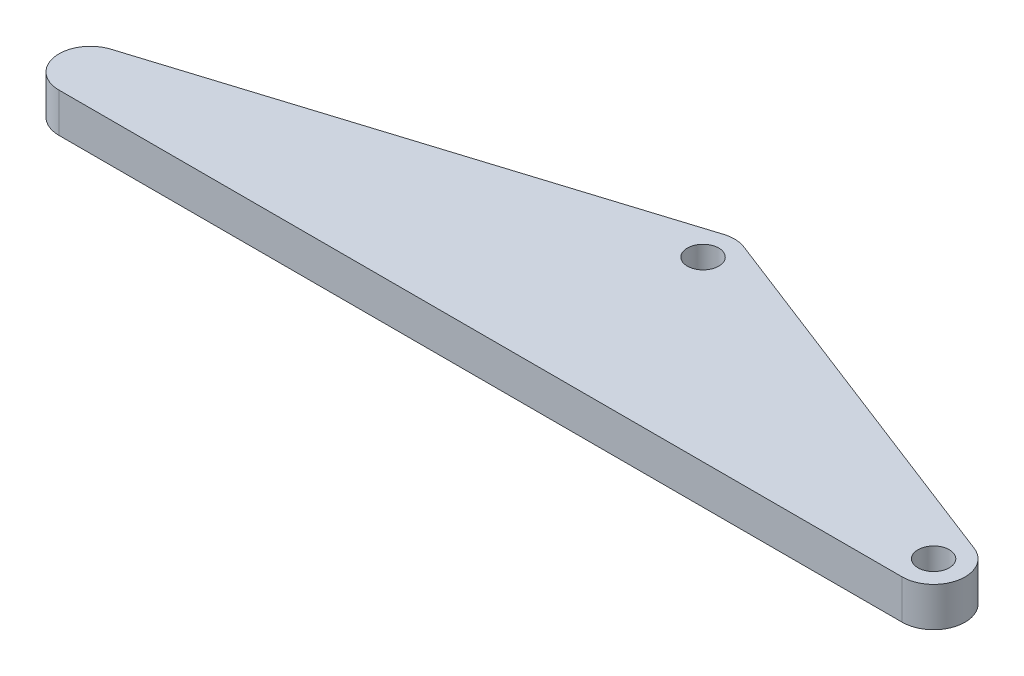
ISO-10303-21;
HEADER;
FILE_DESCRIPTION(('STEP AP214'),'2;1');
FILE_NAME('part.step','',(''),(''),'','','');
FILE_SCHEMA(('AUTOMOTIVE_DESIGN { 1 0 10303 214 1 1 1 1 }'));
ENDSEC;
DATA;
#1=APPLICATION_CONTEXT('core data for automotive mechanical design processes');
#2=APPLICATION_PROTOCOL_DEFINITION('international standard','automotive_design',2000,#1);
#3=PRODUCT_CONTEXT('',#1,'mechanical');
#4=PRODUCT('Part','Part','',(#3));
#5=PRODUCT_RELATED_PRODUCT_CATEGORY('part','',(#4));
#6=PRODUCT_DEFINITION_FORMATION('','',#4);
#7=PRODUCT_DEFINITION_CONTEXT('part definition',#1,'design');
#8=PRODUCT_DEFINITION('design','',#6,#7);
#9=PRODUCT_DEFINITION_SHAPE('','',#8);
#10=(LENGTH_UNIT() NAMED_UNIT(*) SI_UNIT(.MILLI.,.METRE.));
#11=(NAMED_UNIT(*) PLANE_ANGLE_UNIT() SI_UNIT($,.RADIAN.));
#12=(NAMED_UNIT(*) SI_UNIT($,.STERADIAN.) SOLID_ANGLE_UNIT());
#13=UNCERTAINTY_MEASURE_WITH_UNIT(LENGTH_MEASURE(1.E-05),#10,'distance_accuracy_value','');
#14=(GEOMETRIC_REPRESENTATION_CONTEXT(3) GLOBAL_UNCERTAINTY_ASSIGNED_CONTEXT((#13)) GLOBAL_UNIT_ASSIGNED_CONTEXT((#10,
#11,#12)) REPRESENTATION_CONTEXT('',''));
#15=CARTESIAN_POINT('',(0.,0.,0.));
#16=DIRECTION('',(0.,0.,1.));
#17=DIRECTION('',(1.,0.,0.));
#18=AXIS2_PLACEMENT_3D('',#15,#16,#17);
#19=CARTESIAN_POINT('',(8.45846730355585,5.,-21.8175835679385));
#20=DIRECTION('',(0.361475397059794,0.,-0.932381647889138));
#21=DIRECTION('',(-0.932381647889138,0.,-0.361475397059794));
#22=AXIS2_PLACEMENT_3D('',#19,#20,#21);
#23=PLANE('',#22);
#24=DIRECTION('',(0.932381647889138,0.,0.361475397059794));
#25=VECTOR('',#24,1.);
#26=CARTESIAN_POINT('',(8.45846730355585,0.,-21.8175835679385));
#27=LINE('',#26,#25);
#28=CARTESIAN_POINT('',(7.18440158823917,0.,-22.3115265915566));
#29=VERTEX_POINT('',#28);
#30=CARTESIAN_POINT('',(55.1144015882392,0.,-3.72952659155658));
#31=VERTEX_POINT('',#30);
#32=EDGE_CURVE('E123',#29,#31,#27,.T.);
#33=ORIENTED_EDGE('',*,*,#32,.F.);
#34=DIRECTION('',(0.,-1.,0.));
#35=VECTOR('',#34,1.);
#36=CARTESIAN_POINT('',(7.18440158823917,5.,-22.3115265915566));
#37=LINE('',#36,#35);
#38=CARTESIAN_POINT('',(7.18440158823917,5.,-22.3115265915566));
#39=VERTEX_POINT('',#38);
#40=EDGE_CURVE('E11',#39,#29,#37,.T.);
#41=ORIENTED_EDGE('',*,*,#40,.F.);
#42=DIRECTION('',(0.932381647889138,0.,0.361475397059794));
#43=VECTOR('',#42,1.);
#44=CARTESIAN_POINT('',(8.45846730355585,5.,-21.8175835679385));
#45=LINE('',#44,#43);
#46=CARTESIAN_POINT('',(55.1144015882392,5.,-3.72952659155658));
#47=VERTEX_POINT('',#46);
#48=EDGE_CURVE('E142',#39,#47,#45,.T.);
#49=ORIENTED_EDGE('',*,*,#48,.T.);
#50=DIRECTION('',(0.,-1.,0.));
#51=VECTOR('',#50,1.);
#52=CARTESIAN_POINT('',(55.1144015882392,5.,-3.72952659155658));
#53=LINE('',#52,#51);
#54=EDGE_CURVE('E81',#47,#31,#53,.T.);
#55=ORIENTED_EDGE('',*,*,#54,.T.);
#56=EDGE_LOOP('',(#33,#41,#49,#55));
#57=FACE_BOUND('',#56,.T.);
#58=ADVANCED_FACE('F36',(#57),#23,.T.);
#59=CARTESIAN_POINT('',(5.73849999999999,5.,-18.582));
#60=DIRECTION('',(0.,-1.,0.));
#61=DIRECTION('',(0.,0.,-1.));
#62=AXIS2_PLACEMENT_3D('',#59,#60,#61);
#63=CYLINDRICAL_SURFACE('',#62,4.);
#64=CARTESIAN_POINT('',(5.73849999999999,0.,-18.582));
#65=DIRECTION('',(0.,1.,0.));
#66=DIRECTION('',(0.,0.,1.));
#67=AXIS2_PLACEMENT_3D('',#64,#65,#66);
#68=CIRCLE('',#67,4.);
#69=CARTESIAN_POINT('',(4.54438651623012,0.,-22.3996030422084));
#70=VERTEX_POINT('',#69);
#71=EDGE_CURVE('E126',#29,#70,#68,.T.);
#72=ORIENTED_EDGE('',*,*,#71,.T.);
#73=DIRECTION('',(0.,-1.,0.));
#74=VECTOR('',#73,1.);
#75=CARTESIAN_POINT('',(4.54438651623012,5.,-22.3996030422084));
#76=LINE('',#75,#74);
#77=CARTESIAN_POINT('',(4.54438651623012,5.,-22.3996030422084));
#78=VERTEX_POINT('',#77);
#79=EDGE_CURVE('E44',#78,#70,#76,.T.);
#80=ORIENTED_EDGE('',*,*,#79,.F.);
#81=CARTESIAN_POINT('',(5.73849999999999,5.,-18.582));
#82=DIRECTION('',(0.,1.,0.));
#83=DIRECTION('',(0.,0.,1.));
#84=AXIS2_PLACEMENT_3D('',#81,#82,#83);
#85=CIRCLE('',#84,4.);
#86=EDGE_CURVE('E158',#39,#78,#85,.T.);
#87=ORIENTED_EDGE('',*,*,#86,.F.);
#88=ORIENTED_EDGE('',*,*,#40,.T.);
#89=EDGE_LOOP('',(#72,#80,#87,#88));
#90=FACE_BOUND('',#89,.T.);
#91=ADVANCED_FACE('F151',(#90),#63,.T.);
#92=CARTESIAN_POINT('',(-5.97700663877095,5.,-19.1086015170308));
#93=DIRECTION('',(-0.298528370942468,0.,-0.954400760552105));
#94=DIRECTION('',(-0.954400760552105,0.,0.298528370942468));
#95=AXIS2_PLACEMENT_3D('',#92,#93,#94);
#96=PLANE('',#95);
#97=DIRECTION('',(0.954400760552105,0.,-0.298528370942468));
#98=VECTOR('',#97,1.);
#99=CARTESIAN_POINT('',(-5.97700663877095,0.,-19.1086015170308));
#100=LINE('',#99,#98);
#101=CARTESIAN_POINT('',(-54.8626134837699,0.,-3.81760304220843));
#102=VERTEX_POINT('',#101);
#103=EDGE_CURVE('E129',#102,#70,#100,.T.);
#104=ORIENTED_EDGE('',*,*,#103,.F.);
#105=DIRECTION('',(0.,-1.,0.));
#106=VECTOR('',#105,1.);
#107=CARTESIAN_POINT('',(-54.8626134837699,5.,-3.81760304220843));
#108=LINE('',#107,#106);
#109=CARTESIAN_POINT('',(-54.8626134837699,5.,-3.81760304220843));
#110=VERTEX_POINT('',#109);
#111=EDGE_CURVE('E109',#110,#102,#108,.T.);
#112=ORIENTED_EDGE('',*,*,#111,.F.);
#113=DIRECTION('',(0.954400760552105,0.,-0.298528370942468));
#114=VECTOR('',#113,1.);
#115=CARTESIAN_POINT('',(-5.97700663877095,5.,-19.1086015170308));
#116=LINE('',#115,#114);
#117=EDGE_CURVE('E102',#110,#78,#116,.T.);
#118=ORIENTED_EDGE('',*,*,#117,.T.);
#119=ORIENTED_EDGE('',*,*,#79,.T.);
#120=EDGE_LOOP('',(#104,#112,#118,#119));
#121=FACE_BOUND('',#120,.T.);
#122=ADVANCED_FACE('F148',(#121),#96,.T.);
#123=CARTESIAN_POINT('',(-53.6685,5.,0.));
#124=DIRECTION('',(0.,-1.,0.));
#125=DIRECTION('',(0.,0.,-1.));
#126=AXIS2_PLACEMENT_3D('',#123,#124,#125);
#127=CYLINDRICAL_SURFACE('',#126,4.00000000000002);
#128=CARTESIAN_POINT('',(-53.6685,0.,0.));
#129=DIRECTION('',(0.,1.,0.));
#130=DIRECTION('',(0.,0.,1.));
#131=AXIS2_PLACEMENT_3D('',#128,#129,#130);
#132=CIRCLE('',#131,4.00000000000002);
#133=CARTESIAN_POINT('',(-53.6685,0.,4.00000000000002));
#134=VERTEX_POINT('',#133);
#135=EDGE_CURVE('E108',#102,#134,#132,.T.);
#136=ORIENTED_EDGE('',*,*,#135,.T.);
#137=DIRECTION('',(0.,-1.,0.));
#138=VECTOR('',#137,1.);
#139=CARTESIAN_POINT('',(-53.6685,5.,4.00000000000002));
#140=LINE('',#139,#138);
#141=CARTESIAN_POINT('',(-53.6685,5.,4.00000000000002));
#142=VERTEX_POINT('',#141);
#143=EDGE_CURVE('E105',#142,#134,#140,.T.);
#144=ORIENTED_EDGE('',*,*,#143,.F.);
#145=CARTESIAN_POINT('',(-53.6685,5.,0.));
#146=DIRECTION('',(0.,1.,0.));
#147=DIRECTION('',(0.,0.,1.));
#148=AXIS2_PLACEMENT_3D('',#145,#146,#147);
#149=CIRCLE('',#148,4.00000000000002);
#150=EDGE_CURVE('E95',#110,#142,#149,.T.);
#151=ORIENTED_EDGE('',*,*,#150,.F.);
#152=ORIENTED_EDGE('',*,*,#111,.T.);
#153=EDGE_LOOP('',(#136,#144,#151,#152));
#154=FACE_BOUND('',#153,.T.);
#155=ADVANCED_FACE('F106',(#154),#127,.T.);
#156=CARTESIAN_POINT('',(0.,5.,4.00000000000002));
#157=DIRECTION('',(0.,0.,-1.));
#158=DIRECTION('',(-1.,0.,0.));
#159=AXIS2_PLACEMENT_3D('',#156,#157,#158);
#160=PLANE('',#159);
#161=DIRECTION('',(1.,0.,0.));
#162=VECTOR('',#161,1.);
#163=CARTESIAN_POINT('',(0.,0.,4.00000000000002));
#164=LINE('',#163,#162);
#165=CARTESIAN_POINT('',(53.6685,0.,4.));
#166=VERTEX_POINT('',#165);
#167=EDGE_CURVE('E74',#134,#166,#164,.T.);
#168=ORIENTED_EDGE('',*,*,#167,.T.);
#169=DIRECTION('',(0.,-1.,0.));
#170=VECTOR('',#169,1.);
#171=CARTESIAN_POINT('',(53.6685,5.,4.));
#172=LINE('',#171,#170);
#173=CARTESIAN_POINT('',(53.6685,5.,4.));
#174=VERTEX_POINT('',#173);
#175=EDGE_CURVE('E110',#174,#166,#172,.T.);
#176=ORIENTED_EDGE('',*,*,#175,.F.);
#177=DIRECTION('',(1.,0.,0.));
#178=VECTOR('',#177,1.);
#179=CARTESIAN_POINT('',(0.,5.,4.00000000000002));
#180=LINE('',#179,#178);
#181=EDGE_CURVE('E100',#142,#174,#180,.T.);
#182=ORIENTED_EDGE('',*,*,#181,.F.);
#183=ORIENTED_EDGE('',*,*,#143,.T.);
#184=EDGE_LOOP('',(#168,#176,#182,#183));
#185=FACE_BOUND('',#184,.T.);
#186=ADVANCED_FACE('F112',(#185),#160,.F.);
#187=CARTESIAN_POINT('',(53.6685,5.,0.));
#188=DIRECTION('',(0.,-1.,0.));
#189=DIRECTION('',(0.,0.,-1.));
#190=AXIS2_PLACEMENT_3D('',#187,#188,#189);
#191=CYLINDRICAL_SURFACE('',#190,2.);
#192=CARTESIAN_POINT('',(53.6685,5.,0.));
#193=DIRECTION('',(0.,1.,0.));
#194=DIRECTION('',(0.,0.,1.));
#195=AXIS2_PLACEMENT_3D('',#192,#193,#194);
#196=CIRCLE('',#195,2.);
#197=CARTESIAN_POINT('',(53.6685,5.,1.99999999999998));
#198=VERTEX_POINT('',#197);
#199=EDGE_CURVE('E114',#198,#198,#196,.T.);
#200=ORIENTED_EDGE('',*,*,#199,.T.);
#201=EDGE_LOOP('',(#200));
#202=FACE_BOUND('',#201,.T.);
#203=CARTESIAN_POINT('',(53.6685,0.,0.));
#204=DIRECTION('',(0.,1.,0.));
#205=DIRECTION('',(0.,0.,1.));
#206=AXIS2_PLACEMENT_3D('',#203,#204,#205);
#207=CIRCLE('',#206,2.);
#208=CARTESIAN_POINT('',(53.6685,0.,1.99999999999998));
#209=VERTEX_POINT('',#208);
#210=EDGE_CURVE('E136',#209,#209,#207,.T.);
#211=ORIENTED_EDGE('',*,*,#210,.F.);
#212=EDGE_LOOP('',(#211));
#213=FACE_BOUND('',#212,.T.);
#214=ADVANCED_FACE('F174',(#202,#213),#191,.F.);
#215=CARTESIAN_POINT('',(53.6685,5.,0.));
#216=DIRECTION('',(0.,-1.,0.));
#217=DIRECTION('',(0.,0.,-1.));
#218=AXIS2_PLACEMENT_3D('',#215,#216,#217);
#219=CYLINDRICAL_SURFACE('',#218,4.00000000000001);
#220=CARTESIAN_POINT('',(53.6685,0.,0.));
#221=DIRECTION('',(0.,1.,0.));
#222=DIRECTION('',(0.,0.,1.));
#223=AXIS2_PLACEMENT_3D('',#220,#221,#222);
#224=CIRCLE('',#223,4.00000000000001);
#225=EDGE_CURVE('E134',#166,#31,#224,.T.);
#226=ORIENTED_EDGE('',*,*,#225,.T.);
#227=ORIENTED_EDGE('',*,*,#54,.F.);
#228=CARTESIAN_POINT('',(53.6685,5.,0.));
#229=DIRECTION('',(0.,1.,0.));
#230=DIRECTION('',(0.,0.,1.));
#231=AXIS2_PLACEMENT_3D('',#228,#229,#230);
#232=CIRCLE('',#231,4.00000000000001);
#233=EDGE_CURVE('E52',#174,#47,#232,.T.);
#234=ORIENTED_EDGE('',*,*,#233,.F.);
#235=ORIENTED_EDGE('',*,*,#175,.T.);
#236=EDGE_LOOP('',(#226,#227,#234,#235));
#237=FACE_BOUND('',#236,.T.);
#238=ADVANCED_FACE('F157',(#237),#219,.T.);
#239=CARTESIAN_POINT('',(5.73849999999999,5.,-18.582));
#240=DIRECTION('',(0.,-1.,0.));
#241=DIRECTION('',(0.,0.,-1.));
#242=AXIS2_PLACEMENT_3D('',#239,#240,#241);
#243=CYLINDRICAL_SURFACE('',#242,2.);
#244=CARTESIAN_POINT('',(5.73849999999999,5.,-18.582));
#245=DIRECTION('',(0.,1.,0.));
#246=DIRECTION('',(0.,0.,1.));
#247=AXIS2_PLACEMENT_3D('',#244,#245,#246);
#248=CIRCLE('',#247,2.);
#249=CARTESIAN_POINT('',(5.73849999999999,5.,-16.582));
#250=VERTEX_POINT('',#249);
#251=EDGE_CURVE('E120',#250,#250,#248,.T.);
#252=ORIENTED_EDGE('',*,*,#251,.T.);
#253=EDGE_LOOP('',(#252));
#254=FACE_BOUND('',#253,.T.);
#255=CARTESIAN_POINT('',(5.73849999999999,0.,-18.582));
#256=DIRECTION('',(0.,1.,0.));
#257=DIRECTION('',(0.,0.,1.));
#258=AXIS2_PLACEMENT_3D('',#255,#256,#257);
#259=CIRCLE('',#258,2.);
#260=CARTESIAN_POINT('',(5.73849999999999,0.,-16.582));
#261=VERTEX_POINT('',#260);
#262=EDGE_CURVE('E139',#261,#261,#259,.T.);
#263=ORIENTED_EDGE('',*,*,#262,.F.);
#264=EDGE_LOOP('',(#263));
#265=FACE_BOUND('',#264,.T.);
#266=ADVANCED_FACE('F177',(#254,#265),#243,.F.);
#267=CARTESIAN_POINT('',(0.,5.,0.));
#268=DIRECTION('',(0.,1.,0.));
#269=DIRECTION('',(0.,0.,1.));
#270=AXIS2_PLACEMENT_3D('',#267,#268,#269);
#271=PLANE('',#270);
#272=ORIENTED_EDGE('',*,*,#48,.F.);
#273=ORIENTED_EDGE('',*,*,#86,.T.);
#274=ORIENTED_EDGE('',*,*,#117,.F.);
#275=ORIENTED_EDGE('',*,*,#150,.T.);
#276=ORIENTED_EDGE('',*,*,#181,.T.);
#277=ORIENTED_EDGE('',*,*,#233,.T.);
#278=EDGE_LOOP('',(#272,#273,#274,#275,#276,#277));
#279=FACE_BOUND('',#278,.T.);
#280=ORIENTED_EDGE('',*,*,#199,.F.);
#281=EDGE_LOOP('',(#280));
#282=FACE_BOUND('',#281,.T.);
#283=ORIENTED_EDGE('',*,*,#251,.F.);
#284=EDGE_LOOP('',(#283));
#285=FACE_BOUND('',#284,.T.);
#286=ADVANCED_FACE('F97',(#279,#282,#285),#271,.T.);
#287=CARTESIAN_POINT('',(0.,0.,0.));
#288=DIRECTION('',(0.,1.,0.));
#289=DIRECTION('',(0.,0.,1.));
#290=AXIS2_PLACEMENT_3D('',#287,#288,#289);
#291=PLANE('',#290);
#292=ORIENTED_EDGE('',*,*,#32,.T.);
#293=ORIENTED_EDGE('',*,*,#225,.F.);
#294=ORIENTED_EDGE('',*,*,#167,.F.);
#295=ORIENTED_EDGE('',*,*,#135,.F.);
#296=ORIENTED_EDGE('',*,*,#103,.T.);
#297=ORIENTED_EDGE('',*,*,#71,.F.);
#298=EDGE_LOOP('',(#292,#293,#294,#295,#296,#297));
#299=FACE_BOUND('',#298,.T.);
#300=ORIENTED_EDGE('',*,*,#210,.T.);
#301=EDGE_LOOP('',(#300));
#302=FACE_BOUND('',#301,.T.);
#303=ORIENTED_EDGE('',*,*,#262,.T.);
#304=EDGE_LOOP('',(#303));
#305=FACE_BOUND('',#304,.T.);
#306=ADVANCED_FACE('F153',(#299,#302,#305),#291,.F.);
#307=CLOSED_SHELL('',(#58,#91,#122,#155,#186,#214,#238,#266,#286,#306));
#308=MANIFOLD_SOLID_BREP('B2',#307);
#309=ADVANCED_BREP_SHAPE_REPRESENTATION('',(#18,#308),#14);
#310=SHAPE_DEFINITION_REPRESENTATION(#9,#309);
ENDSEC;
END-ISO-10303-21;
